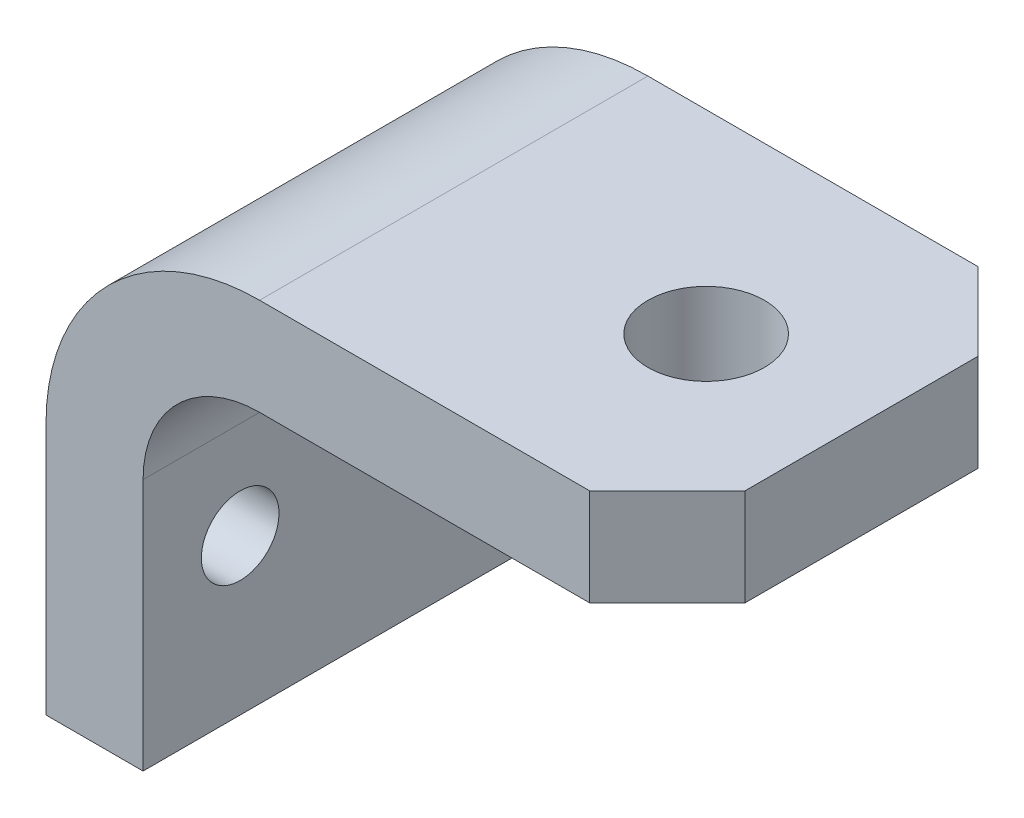
ISO-10303-21;
HEADER;
FILE_DESCRIPTION(('STEP AP214'),'2;1');
FILE_NAME('part.step','',(''),(''),'','','');
FILE_SCHEMA(('AUTOMOTIVE_DESIGN { 1 0 10303 214 1 1 1 1 }'));
ENDSEC;
DATA;
#1=APPLICATION_CONTEXT('core data for automotive mechanical design processes');
#2=APPLICATION_PROTOCOL_DEFINITION('international standard','automotive_design',2000,#1);
#3=PRODUCT_CONTEXT('',#1,'mechanical');
#4=PRODUCT('Part','Part','',(#3));
#5=PRODUCT_RELATED_PRODUCT_CATEGORY('part','',(#4));
#6=PRODUCT_DEFINITION_FORMATION('','',#4);
#7=PRODUCT_DEFINITION_CONTEXT('part definition',#1,'design');
#8=PRODUCT_DEFINITION('design','',#6,#7);
#9=PRODUCT_DEFINITION_SHAPE('','',#8);
#10=(LENGTH_UNIT() NAMED_UNIT(*) SI_UNIT(.MILLI.,.METRE.));
#11=(NAMED_UNIT(*) PLANE_ANGLE_UNIT() SI_UNIT($,.RADIAN.));
#12=(NAMED_UNIT(*) SI_UNIT($,.STERADIAN.) SOLID_ANGLE_UNIT());
#13=UNCERTAINTY_MEASURE_WITH_UNIT(LENGTH_MEASURE(1.E-05),#10,'distance_accuracy_value','');
#14=(GEOMETRIC_REPRESENTATION_CONTEXT(3) GLOBAL_UNCERTAINTY_ASSIGNED_CONTEXT((#13)) GLOBAL_UNIT_ASSIGNED_CONTEXT((#10,
#11,#12)) REPRESENTATION_CONTEXT('',''));
#15=CARTESIAN_POINT('',(0.,0.,0.));
#16=DIRECTION('',(0.,0.,1.));
#17=DIRECTION('',(1.,0.,0.));
#18=AXIS2_PLACEMENT_3D('',#15,#16,#17);
#19=CARTESIAN_POINT('',(25.4,0.,31.75));
#20=DIRECTION('',(-1.,0.,0.));
#21=DIRECTION('',(0.,-1.,0.));
#22=AXIS2_PLACEMENT_3D('',#19,#20,#21);
#23=PLANE('',#22);
#24=DIRECTION('',(0.,0.,-1.));
#25=VECTOR('',#24,1.);
#26=CARTESIAN_POINT('',(25.4,15.875,31.75));
#27=LINE('',#26,#25);
#28=CARTESIAN_POINT('',(25.4,15.875,19.0500000000001));
#29=VERTEX_POINT('',#28);
#30=CARTESIAN_POINT('',(25.4,15.875,-19.0500000000001));
#31=VERTEX_POINT('',#30);
#32=EDGE_CURVE('E131',#29,#31,#27,.T.);
#33=ORIENTED_EDGE('',*,*,#32,.F.);
#34=DIRECTION('',(0.,1.,0.));
#35=VECTOR('',#34,1.);
#36=CARTESIAN_POINT('',(25.4,-60.325,19.0500000000001));
#37=LINE('',#36,#35);
#38=CARTESIAN_POINT('',(25.4,0.,19.0500000000001));
#39=VERTEX_POINT('',#38);
#40=EDGE_CURVE('E119',#39,#29,#37,.T.);
#41=ORIENTED_EDGE('',*,*,#40,.F.);
#42=DIRECTION('',(0.,0.,-1.));
#43=VECTOR('',#42,1.);
#44=CARTESIAN_POINT('',(25.4,0.,31.75));
#45=LINE('',#44,#43);
#46=CARTESIAN_POINT('',(25.4,0.,-19.0500000000001));
#47=VERTEX_POINT('',#46);
#48=EDGE_CURVE('E202',#39,#47,#45,.T.);
#49=ORIENTED_EDGE('',*,*,#48,.T.);
#50=DIRECTION('',(0.,1.,0.));
#51=VECTOR('',#50,1.);
#52=CARTESIAN_POINT('',(25.4,-60.325,-19.0500000000001));
#53=LINE('',#52,#51);
#54=EDGE_CURVE('E138',#47,#31,#53,.T.);
#55=ORIENTED_EDGE('',*,*,#54,.T.);
#56=EDGE_LOOP('',(#33,#41,#49,#55));
#57=FACE_BOUND('',#56,.T.);
#58=ADVANCED_FACE('F45',(#57),#23,.F.);
#59=CARTESIAN_POINT('',(25.4,15.875,31.75));
#60=DIRECTION('',(0.,-1.,0.));
#61=DIRECTION('',(1.,0.,0.));
#62=AXIS2_PLACEMENT_3D('',#59,#60,#61);
#63=PLANE('',#62);
#64=CARTESIAN_POINT('',(0.,15.875,0.));
#65=DIRECTION('',(0.,1.,0.));
#66=DIRECTION('',(-1.,0.,0.));
#67=AXIS2_PLACEMENT_3D('',#64,#65,#66);
#68=CIRCLE('',#67,9.525);
#69=CARTESIAN_POINT('',(-9.525,15.875,0.));
#70=VERTEX_POINT('',#69);
#71=EDGE_CURVE('E149',#70,#70,#68,.T.);
#72=ORIENTED_EDGE('',*,*,#71,.F.);
#73=EDGE_LOOP('',(#72));
#74=FACE_BOUND('',#73,.T.);
#75=DIRECTION('',(-1.,0.,0.));
#76=VECTOR('',#75,1.);
#77=CARTESIAN_POINT('',(25.4,15.875,31.75));
#78=LINE('',#77,#76);
#79=CARTESIAN_POINT('',(12.7,15.875,31.75));
#80=VERTEX_POINT('',#79);
#81=CARTESIAN_POINT('',(-41.275,15.875,31.75));
#82=VERTEX_POINT('',#81);
#83=EDGE_CURVE('E134',#80,#82,#78,.T.);
#84=ORIENTED_EDGE('',*,*,#83,.F.);
#85=DIRECTION('',(-0.707106781186551,0.,0.707106781186544));
#86=VECTOR('',#85,1.);
#87=CARTESIAN_POINT('',(12.7,15.875,31.75));
#88=LINE('',#87,#86);
#89=EDGE_CURVE('E58',#29,#80,#88,.T.);
#90=ORIENTED_EDGE('',*,*,#89,.F.);
#91=ORIENTED_EDGE('',*,*,#32,.T.);
#92=DIRECTION('',(0.707106781186551,0.,0.707106781186544));
#93=VECTOR('',#92,1.);
#94=CARTESIAN_POINT('',(12.7,15.875,-31.75));
#95=LINE('',#94,#93);
#96=CARTESIAN_POINT('',(12.7,15.875,-31.75));
#97=VERTEX_POINT('',#96);
#98=EDGE_CURVE('E176',#97,#31,#95,.T.);
#99=ORIENTED_EDGE('',*,*,#98,.F.);
#100=DIRECTION('',(-1.,0.,0.));
#101=VECTOR('',#100,1.);
#102=CARTESIAN_POINT('',(25.4,15.875,-31.75));
#103=LINE('',#102,#101);
#104=CARTESIAN_POINT('',(-41.275,15.875,-31.75));
#105=VERTEX_POINT('',#104);
#106=EDGE_CURVE('E148',#97,#105,#103,.T.);
#107=ORIENTED_EDGE('',*,*,#106,.T.);
#108=DIRECTION('',(0.,0.,-1.));
#109=VECTOR('',#108,1.);
#110=CARTESIAN_POINT('',(-41.275,15.875,31.75));
#111=LINE('',#110,#109);
#112=EDGE_CURVE('E139',#82,#105,#111,.T.);
#113=ORIENTED_EDGE('',*,*,#112,.F.);
#114=EDGE_LOOP('',(#84,#90,#91,#99,#107,#113));
#115=FACE_BOUND('',#114,.T.);
#116=ADVANCED_FACE('F129',(#74,#115),#63,.F.);
#117=CARTESIAN_POINT('',(-41.275,-19.05,31.75));
#118=DIRECTION('',(0.,0.,-1.));
#119=DIRECTION('',(-1.,0.,0.));
#120=AXIS2_PLACEMENT_3D('',#117,#118,#119);
#121=CYLINDRICAL_SURFACE('',#120,34.925);
#122=CARTESIAN_POINT('',(-41.275,-19.05,-31.75));
#123=DIRECTION('',(0.,0.,1.));
#124=DIRECTION('',(1.,0.,0.));
#125=AXIS2_PLACEMENT_3D('',#122,#123,#124);
#126=CIRCLE('',#125,34.925);
#127=CARTESIAN_POINT('',(-76.2,-19.05,-31.75));
#128=VERTEX_POINT('',#127);
#129=EDGE_CURVE('E152',#105,#128,#126,.T.);
#130=ORIENTED_EDGE('',*,*,#129,.T.);
#131=DIRECTION('',(0.,0.,-1.));
#132=VECTOR('',#131,1.);
#133=CARTESIAN_POINT('',(-76.2,-19.05,31.75));
#134=LINE('',#133,#132);
#135=CARTESIAN_POINT('',(-76.2,-19.05,31.75));
#136=VERTEX_POINT('',#135);
#137=EDGE_CURVE('E142',#136,#128,#134,.T.);
#138=ORIENTED_EDGE('',*,*,#137,.F.);
#139=CARTESIAN_POINT('',(-41.275,-19.05,31.75));
#140=DIRECTION('',(0.,0.,1.));
#141=DIRECTION('',(1.,0.,0.));
#142=AXIS2_PLACEMENT_3D('',#139,#140,#141);
#143=CIRCLE('',#142,34.925);
#144=EDGE_CURVE('E223',#82,#136,#143,.T.);
#145=ORIENTED_EDGE('',*,*,#144,.F.);
#146=ORIENTED_EDGE('',*,*,#112,.T.);
#147=EDGE_LOOP('',(#130,#138,#145,#146));
#148=FACE_BOUND('',#147,.T.);
#149=ADVANCED_FACE('F222',(#148),#121,.T.);
#150=CARTESIAN_POINT('',(-76.2,-60.325,31.75));
#151=DIRECTION('',(1.,0.,0.));
#152=DIRECTION('',(0.,0.,-1.));
#153=AXIS2_PLACEMENT_3D('',#150,#151,#152);
#154=PLANE('',#153);
#155=CARTESIAN_POINT('',(-76.2,-34.925,-15.875));
#156=DIRECTION('',(1.,0.,0.));
#157=DIRECTION('',(0.,0.,-1.));
#158=AXIS2_PLACEMENT_3D('',#155,#156,#157);
#159=CIRCLE('',#158,6.35);
#160=CARTESIAN_POINT('',(-76.2,-34.925,-22.225));
#161=VERTEX_POINT('',#160);
#162=EDGE_CURVE('E172',#161,#161,#159,.F.);
#163=ORIENTED_EDGE('',*,*,#162,.F.);
#164=EDGE_LOOP('',(#163));
#165=FACE_BOUND('',#164,.T.);
#166=CARTESIAN_POINT('',(-76.2,-34.925,15.875));
#167=DIRECTION('',(1.,0.,0.));
#168=DIRECTION('',(0.,0.,-1.));
#169=AXIS2_PLACEMENT_3D('',#166,#167,#168);
#170=CIRCLE('',#169,6.35);
#171=CARTESIAN_POINT('',(-76.2,-34.925,9.525));
#172=VERTEX_POINT('',#171);
#173=EDGE_CURVE('E135',#172,#172,#170,.F.);
#174=ORIENTED_EDGE('',*,*,#173,.F.);
#175=EDGE_LOOP('',(#174));
#176=FACE_BOUND('',#175,.T.);
#177=DIRECTION('',(0.,-1.,0.));
#178=VECTOR('',#177,1.);
#179=CARTESIAN_POINT('',(-76.2,-60.325,-31.75));
#180=LINE('',#179,#178);
#181=CARTESIAN_POINT('',(-76.2,-60.325,-31.75));
#182=VERTEX_POINT('',#181);
#183=EDGE_CURVE('E186',#128,#182,#180,.T.);
#184=ORIENTED_EDGE('',*,*,#183,.T.);
#185=DIRECTION('',(0.,0.,-1.));
#186=VECTOR('',#185,1.);
#187=CARTESIAN_POINT('',(-76.2,-60.325,31.75));
#188=LINE('',#187,#186);
#189=CARTESIAN_POINT('',(-76.2,-60.325,31.75));
#190=VERTEX_POINT('',#189);
#191=EDGE_CURVE('E214',#190,#182,#188,.T.);
#192=ORIENTED_EDGE('',*,*,#191,.F.);
#193=DIRECTION('',(0.,-1.,0.));
#194=VECTOR('',#193,1.);
#195=CARTESIAN_POINT('',(-76.2,-60.325,31.75));
#196=LINE('',#195,#194);
#197=EDGE_CURVE('E220',#136,#190,#196,.T.);
#198=ORIENTED_EDGE('',*,*,#197,.F.);
#199=ORIENTED_EDGE('',*,*,#137,.T.);
#200=EDGE_LOOP('',(#184,#192,#198,#199));
#201=FACE_BOUND('',#200,.T.);
#202=ADVANCED_FACE('F218',(#165,#176,#201),#154,.F.);
#203=CARTESIAN_POINT('',(-76.2,-60.325,31.75));
#204=DIRECTION('',(0.,1.,0.));
#205=DIRECTION('',(0.,0.,1.));
#206=AXIS2_PLACEMENT_3D('',#203,#204,#205);
#207=PLANE('',#206);
#208=DIRECTION('',(1.,0.,0.));
#209=VECTOR('',#208,1.);
#210=CARTESIAN_POINT('',(-76.2,-60.325,-31.75));
#211=LINE('',#210,#209);
#212=CARTESIAN_POINT('',(-60.325,-60.325,-31.75));
#213=VERTEX_POINT('',#212);
#214=EDGE_CURVE('E191',#182,#213,#211,.T.);
#215=ORIENTED_EDGE('',*,*,#214,.T.);
#216=DIRECTION('',(0.,0.,-1.));
#217=VECTOR('',#216,1.);
#218=CARTESIAN_POINT('',(-60.325,-60.325,31.75));
#219=LINE('',#218,#217);
#220=CARTESIAN_POINT('',(-60.325,-60.325,31.75));
#221=VERTEX_POINT('',#220);
#222=EDGE_CURVE('E211',#221,#213,#219,.T.);
#223=ORIENTED_EDGE('',*,*,#222,.F.);
#224=DIRECTION('',(1.,0.,0.));
#225=VECTOR('',#224,1.);
#226=CARTESIAN_POINT('',(-76.2,-60.325,31.75));
#227=LINE('',#226,#225);
#228=EDGE_CURVE('E225',#190,#221,#227,.T.);
#229=ORIENTED_EDGE('',*,*,#228,.F.);
#230=ORIENTED_EDGE('',*,*,#191,.T.);
#231=EDGE_LOOP('',(#215,#223,#229,#230));
#232=FACE_BOUND('',#231,.T.);
#233=ADVANCED_FACE('F250',(#232),#207,.F.);
#234=CARTESIAN_POINT('',(-60.325,-60.325,31.75));
#235=DIRECTION('',(-1.,0.,0.));
#236=DIRECTION('',(0.,-1.,0.));
#237=AXIS2_PLACEMENT_3D('',#234,#235,#236);
#238=PLANE('',#237);
#239=CARTESIAN_POINT('',(-60.325,-34.925,-15.875));
#240=DIRECTION('',(1.,0.,0.));
#241=DIRECTION('',(0.,1.,0.));
#242=AXIS2_PLACEMENT_3D('',#239,#240,#241);
#243=CIRCLE('',#242,6.35);
#244=CARTESIAN_POINT('',(-60.325,-28.575,-15.875));
#245=VERTEX_POINT('',#244);
#246=EDGE_CURVE('E395',#245,#245,#243,.T.);
#247=ORIENTED_EDGE('',*,*,#246,.F.);
#248=EDGE_LOOP('',(#247));
#249=FACE_BOUND('',#248,.T.);
#250=CARTESIAN_POINT('',(-60.325,-34.925,15.875));
#251=DIRECTION('',(1.,0.,0.));
#252=DIRECTION('',(0.,1.,0.));
#253=AXIS2_PLACEMENT_3D('',#250,#251,#252);
#254=CIRCLE('',#253,6.35);
#255=CARTESIAN_POINT('',(-60.325,-28.575,15.875));
#256=VERTEX_POINT('',#255);
#257=EDGE_CURVE('E167',#256,#256,#254,.T.);
#258=ORIENTED_EDGE('',*,*,#257,.F.);
#259=EDGE_LOOP('',(#258));
#260=FACE_BOUND('',#259,.T.);
#261=DIRECTION('',(0.,1.,0.));
#262=VECTOR('',#261,1.);
#263=CARTESIAN_POINT('',(-60.325,-60.325,-31.75));
#264=LINE('',#263,#262);
#265=CARTESIAN_POINT('',(-60.325,-19.05,-31.75));
#266=VERTEX_POINT('',#265);
#267=EDGE_CURVE('E196',#213,#266,#264,.T.);
#268=ORIENTED_EDGE('',*,*,#267,.T.);
#269=DIRECTION('',(0.,0.,-1.));
#270=VECTOR('',#269,1.);
#271=CARTESIAN_POINT('',(-60.325,-19.05,31.75));
#272=LINE('',#271,#270);
#273=CARTESIAN_POINT('',(-60.325,-19.05,31.75));
#274=VERTEX_POINT('',#273);
#275=EDGE_CURVE('E208',#274,#266,#272,.T.);
#276=ORIENTED_EDGE('',*,*,#275,.F.);
#277=DIRECTION('',(0.,1.,0.));
#278=VECTOR('',#277,1.);
#279=CARTESIAN_POINT('',(-60.325,-60.325,31.75));
#280=LINE('',#279,#278);
#281=EDGE_CURVE('E229',#221,#274,#280,.T.);
#282=ORIENTED_EDGE('',*,*,#281,.F.);
#283=ORIENTED_EDGE('',*,*,#222,.T.);
#284=EDGE_LOOP('',(#268,#276,#282,#283));
#285=FACE_BOUND('',#284,.T.);
#286=ADVANCED_FACE('F246',(#249,#260,#285),#238,.F.);
#287=CARTESIAN_POINT('',(-41.275,-19.05,31.75));
#288=DIRECTION('',(0.,0.,-1.));
#289=DIRECTION('',(-1.,0.,0.));
#290=AXIS2_PLACEMENT_3D('',#287,#288,#289);
#291=CYLINDRICAL_SURFACE('',#290,19.05);
#292=CARTESIAN_POINT('',(-41.275,-19.05,-31.75));
#293=DIRECTION('',(0.,0.,-1.));
#294=DIRECTION('',(1.,0.,0.));
#295=AXIS2_PLACEMENT_3D('',#292,#293,#294);
#296=CIRCLE('',#295,19.05);
#297=CARTESIAN_POINT('',(-41.275,0.,-31.75));
#298=VERTEX_POINT('',#297);
#299=EDGE_CURVE('E198',#266,#298,#296,.T.);
#300=ORIENTED_EDGE('',*,*,#299,.T.);
#301=DIRECTION('',(0.,0.,-1.));
#302=VECTOR('',#301,1.);
#303=CARTESIAN_POINT('',(-41.275,0.,31.75));
#304=LINE('',#303,#302);
#305=CARTESIAN_POINT('',(-41.275,0.,31.75));
#306=VERTEX_POINT('',#305);
#307=EDGE_CURVE('E204',#306,#298,#304,.T.);
#308=ORIENTED_EDGE('',*,*,#307,.F.);
#309=CARTESIAN_POINT('',(-41.275,-19.05,31.75));
#310=DIRECTION('',(0.,0.,-1.));
#311=DIRECTION('',(1.,0.,0.));
#312=AXIS2_PLACEMENT_3D('',#309,#310,#311);
#313=CIRCLE('',#312,19.05);
#314=EDGE_CURVE('E231',#274,#306,#313,.T.);
#315=ORIENTED_EDGE('',*,*,#314,.F.);
#316=ORIENTED_EDGE('',*,*,#275,.T.);
#317=EDGE_LOOP('',(#300,#308,#315,#316));
#318=FACE_BOUND('',#317,.T.);
#319=ADVANCED_FACE('F242',(#318),#291,.F.);
#320=CARTESIAN_POINT('',(25.4,0.,31.75));
#321=DIRECTION('',(0.,1.,0.));
#322=DIRECTION('',(-1.,0.,0.));
#323=AXIS2_PLACEMENT_3D('',#320,#321,#322);
#324=PLANE('',#323);
#325=CARTESIAN_POINT('',(0.,0.,0.));
#326=DIRECTION('',(0.,1.,0.));
#327=DIRECTION('',(-1.,0.,0.));
#328=AXIS2_PLACEMENT_3D('',#325,#326,#327);
#329=CIRCLE('',#328,9.525);
#330=CARTESIAN_POINT('',(-9.525,0.,0.));
#331=VERTEX_POINT('',#330);
#332=EDGE_CURVE('E146',#331,#331,#329,.T.);
#333=ORIENTED_EDGE('',*,*,#332,.T.);
#334=EDGE_LOOP('',(#333));
#335=FACE_BOUND('',#334,.T.);
#336=ORIENTED_EDGE('',*,*,#48,.F.);
#337=DIRECTION('',(-0.707106781186551,0.,0.707106781186544));
#338=VECTOR('',#337,1.);
#339=CARTESIAN_POINT('',(19.0500000000001,0.,25.4));
#340=LINE('',#339,#338);
#341=CARTESIAN_POINT('',(12.7,0.,31.75));
#342=VERTEX_POINT('',#341);
#343=EDGE_CURVE('E122',#39,#342,#340,.T.);
#344=ORIENTED_EDGE('',*,*,#343,.T.);
#345=DIRECTION('',(1.,0.,0.));
#346=VECTOR('',#345,1.);
#347=CARTESIAN_POINT('',(25.4,0.,31.75));
#348=LINE('',#347,#346);
#349=EDGE_CURVE('E205',#306,#342,#348,.T.);
#350=ORIENTED_EDGE('',*,*,#349,.F.);
#351=ORIENTED_EDGE('',*,*,#307,.T.);
#352=DIRECTION('',(1.,0.,0.));
#353=VECTOR('',#352,1.);
#354=CARTESIAN_POINT('',(25.4,0.,-31.75));
#355=LINE('',#354,#353);
#356=CARTESIAN_POINT('',(12.7,0.,-31.75));
#357=VERTEX_POINT('',#356);
#358=EDGE_CURVE('E200',#298,#357,#355,.T.);
#359=ORIENTED_EDGE('',*,*,#358,.T.);
#360=DIRECTION('',(0.707106781186551,0.,0.707106781186544));
#361=VECTOR('',#360,1.);
#362=CARTESIAN_POINT('',(50.8000000000001,0.,6.34999999999966));
#363=LINE('',#362,#361);
#364=EDGE_CURVE('E66',#357,#47,#363,.T.);
#365=ORIENTED_EDGE('',*,*,#364,.T.);
#366=EDGE_LOOP('',(#336,#344,#350,#351,#359,#365));
#367=FACE_BOUND('',#366,.T.);
#368=ADVANCED_FACE('F238',(#335,#367),#324,.F.);
#369=CARTESIAN_POINT('',(-41.275,-19.05,31.75));
#370=DIRECTION('',(0.,0.,1.));
#371=DIRECTION('',(1.,0.,0.));
#372=AXIS2_PLACEMENT_3D('',#369,#370,#371);
#373=PLANE('',#372);
#374=DIRECTION('',(0.,-1.,0.));
#375=VECTOR('',#374,1.);
#376=CARTESIAN_POINT('',(12.7,-19.05,31.75));
#377=LINE('',#376,#375);
#378=EDGE_CURVE('E12',#80,#342,#377,.T.);
#379=ORIENTED_EDGE('',*,*,#378,.F.);
#380=ORIENTED_EDGE('',*,*,#83,.T.);
#381=ORIENTED_EDGE('',*,*,#144,.T.);
#382=ORIENTED_EDGE('',*,*,#197,.T.);
#383=ORIENTED_EDGE('',*,*,#228,.T.);
#384=ORIENTED_EDGE('',*,*,#281,.T.);
#385=ORIENTED_EDGE('',*,*,#314,.T.);
#386=ORIENTED_EDGE('',*,*,#349,.T.);
#387=EDGE_LOOP('',(#379,#380,#381,#382,#383,#384,#385,#386));
#388=FACE_BOUND('',#387,.T.);
#389=ADVANCED_FACE('F234',(#388),#373,.T.);
#390=CARTESIAN_POINT('',(-41.275,-19.05,-31.75));
#391=DIRECTION('',(0.,0.,1.));
#392=DIRECTION('',(1.,0.,0.));
#393=AXIS2_PLACEMENT_3D('',#390,#391,#392);
#394=PLANE('',#393);
#395=ORIENTED_EDGE('',*,*,#106,.F.);
#396=DIRECTION('',(0.,-1.,0.));
#397=VECTOR('',#396,1.);
#398=CARTESIAN_POINT('',(12.7,-19.05,-31.75));
#399=LINE('',#398,#397);
#400=EDGE_CURVE('E52',#97,#357,#399,.T.);
#401=ORIENTED_EDGE('',*,*,#400,.T.);
#402=ORIENTED_EDGE('',*,*,#358,.F.);
#403=ORIENTED_EDGE('',*,*,#299,.F.);
#404=ORIENTED_EDGE('',*,*,#267,.F.);
#405=ORIENTED_EDGE('',*,*,#214,.F.);
#406=ORIENTED_EDGE('',*,*,#183,.F.);
#407=ORIENTED_EDGE('',*,*,#129,.F.);
#408=EDGE_LOOP('',(#395,#401,#402,#403,#404,#405,#406,#407));
#409=FACE_BOUND('',#408,.T.);
#410=ADVANCED_FACE('F181',(#409),#394,.F.);
#411=CARTESIAN_POINT('',(0.,-60.325,0.));
#412=DIRECTION('',(0.,1.,0.));
#413=DIRECTION('',(-1.,0.,0.));
#414=AXIS2_PLACEMENT_3D('',#411,#412,#413);
#415=CYLINDRICAL_SURFACE('',#414,9.525);
#416=ORIENTED_EDGE('',*,*,#71,.T.);
#417=EDGE_LOOP('',(#416));
#418=FACE_BOUND('',#417,.T.);
#419=ORIENTED_EDGE('',*,*,#332,.F.);
#420=EDGE_LOOP('',(#419));
#421=FACE_BOUND('',#420,.T.);
#422=ADVANCED_FACE('F315',(#418,#421),#415,.F.);
#423=CARTESIAN_POINT('',(12.7,-60.325,-31.75));
#424=DIRECTION('',(-0.707106781186544,0.,0.707106781186551));
#425=DIRECTION('',(0.707106781186551,0.,0.707106781186544));
#426=AXIS2_PLACEMENT_3D('',#423,#424,#425);
#427=PLANE('',#426);
#428=ORIENTED_EDGE('',*,*,#400,.F.);
#429=ORIENTED_EDGE('',*,*,#98,.T.);
#430=ORIENTED_EDGE('',*,*,#54,.F.);
#431=ORIENTED_EDGE('',*,*,#364,.F.);
#432=EDGE_LOOP('',(#428,#429,#430,#431));
#433=FACE_BOUND('',#432,.T.);
#434=ADVANCED_FACE('F177',(#433),#427,.F.);
#435=CARTESIAN_POINT('',(12.7,-60.325,31.75));
#436=DIRECTION('',(-0.707106781186544,0.,-0.707106781186551));
#437=DIRECTION('',(-0.707106781186551,0.,0.707106781186544));
#438=AXIS2_PLACEMENT_3D('',#435,#436,#437);
#439=PLANE('',#438);
#440=ORIENTED_EDGE('',*,*,#40,.T.);
#441=ORIENTED_EDGE('',*,*,#89,.T.);
#442=ORIENTED_EDGE('',*,*,#378,.T.);
#443=ORIENTED_EDGE('',*,*,#343,.F.);
#444=EDGE_LOOP('',(#440,#441,#442,#443));
#445=FACE_BOUND('',#444,.T.);
#446=ADVANCED_FACE('F120',(#445),#439,.F.);
#447=CARTESIAN_POINT('',(-76.201,-34.925,15.875));
#448=DIRECTION('',(1.,0.,0.));
#449=DIRECTION('',(0.,1.,0.));
#450=AXIS2_PLACEMENT_3D('',#447,#448,#449);
#451=CYLINDRICAL_SURFACE('',#450,6.35);
#452=ORIENTED_EDGE('',*,*,#257,.T.);
#453=EDGE_LOOP('',(#452));
#454=FACE_BOUND('',#453,.T.);
#455=ORIENTED_EDGE('',*,*,#173,.T.);
#456=EDGE_LOOP('',(#455));
#457=FACE_BOUND('',#456,.T.);
#458=ADVANCED_FACE('F336',(#454,#457),#451,.F.);
#459=CARTESIAN_POINT('',(-76.201,-34.925,-15.875));
#460=DIRECTION('',(1.,0.,0.));
#461=DIRECTION('',(0.,1.,0.));
#462=AXIS2_PLACEMENT_3D('',#459,#460,#461);
#463=CYLINDRICAL_SURFACE('',#462,6.35);
#464=ORIENTED_EDGE('',*,*,#246,.T.);
#465=EDGE_LOOP('',(#464));
#466=FACE_BOUND('',#465,.T.);
#467=ORIENTED_EDGE('',*,*,#162,.T.);
#468=EDGE_LOOP('',(#467));
#469=FACE_BOUND('',#468,.T.);
#470=ADVANCED_FACE('F343',(#466,#469),#463,.F.);
#471=CLOSED_SHELL('',(#58,#116,#149,#202,#233,#286,#319,#368,#389,#410,#422,#434,#446,#458,#470));
#472=MANIFOLD_SOLID_BREP('B2',#471);
#473=ADVANCED_BREP_SHAPE_REPRESENTATION('',(#18,#472),#14);
#474=SHAPE_DEFINITION_REPRESENTATION(#9,#473);
ENDSEC;
END-ISO-10303-21;
